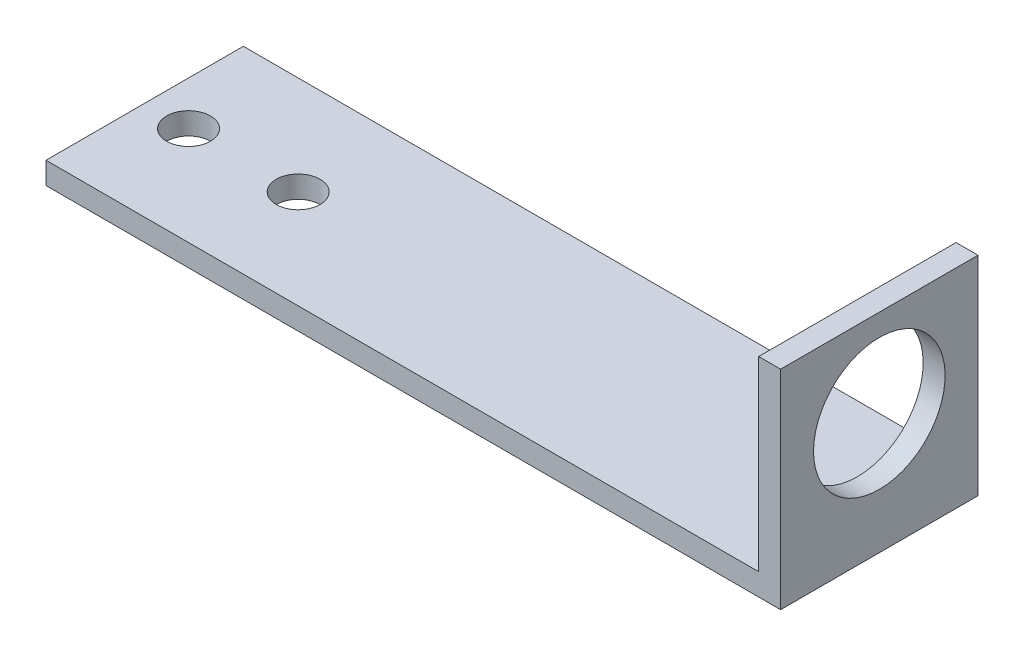
ISO-10303-21;
HEADER;
FILE_DESCRIPTION(('STEP AP214'),'2;1');
FILE_NAME('part.step','',(''),(''),'','','');
FILE_SCHEMA(('AUTOMOTIVE_DESIGN { 1 0 10303 214 1 1 1 1 }'));
ENDSEC;
DATA;
#1=APPLICATION_CONTEXT('core data for automotive mechanical design processes');
#2=APPLICATION_PROTOCOL_DEFINITION('international standard','automotive_design',2000,#1);
#3=PRODUCT_CONTEXT('',#1,'mechanical');
#4=PRODUCT('Part','Part','',(#3));
#5=PRODUCT_RELATED_PRODUCT_CATEGORY('part','',(#4));
#6=PRODUCT_DEFINITION_FORMATION('','',#4);
#7=PRODUCT_DEFINITION_CONTEXT('part definition',#1,'design');
#8=PRODUCT_DEFINITION('design','',#6,#7);
#9=PRODUCT_DEFINITION_SHAPE('','',#8);
#10=(LENGTH_UNIT() NAMED_UNIT(*) SI_UNIT(.MILLI.,.METRE.));
#11=(NAMED_UNIT(*) PLANE_ANGLE_UNIT() SI_UNIT($,.RADIAN.));
#12=(NAMED_UNIT(*) SI_UNIT($,.STERADIAN.) SOLID_ANGLE_UNIT());
#13=UNCERTAINTY_MEASURE_WITH_UNIT(LENGTH_MEASURE(1.E-05),#10,'distance_accuracy_value','');
#14=(GEOMETRIC_REPRESENTATION_CONTEXT(3) GLOBAL_UNCERTAINTY_ASSIGNED_CONTEXT((#13)) GLOBAL_UNIT_ASSIGNED_CONTEXT((#10,
#11,#12)) REPRESENTATION_CONTEXT('',''));
#15=CARTESIAN_POINT('',(0.,0.,0.));
#16=DIRECTION('',(0.,0.,1.));
#17=DIRECTION('',(1.,0.,0.));
#18=AXIS2_PLACEMENT_3D('',#15,#16,#17);
#19=CARTESIAN_POINT('',(-67.,0.,18.));
#20=DIRECTION('',(0.,1.,0.));
#21=DIRECTION('',(0.,0.,1.));
#22=AXIS2_PLACEMENT_3D('',#19,#20,#21);
#23=PLANE('',#22);
#24=CARTESIAN_POINT('',(-63.,0.,9.));
#25=DIRECTION('',(0.,1.,0.));
#26=DIRECTION('',(0.,0.,1.));
#27=AXIS2_PLACEMENT_3D('',#24,#25,#26);
#28=CIRCLE('',#27,2.);
#29=CARTESIAN_POINT('',(-63.,0.,11.));
#30=VERTEX_POINT('',#29);
#31=EDGE_CURVE('E161',#30,#30,#28,.F.);
#32=ORIENTED_EDGE('',*,*,#31,.F.);
#33=EDGE_LOOP('',(#32));
#34=FACE_BOUND('',#33,.T.);
#35=CARTESIAN_POINT('',(-53.,0.,9.));
#36=DIRECTION('',(0.,1.,0.));
#37=DIRECTION('',(0.,0.,1.));
#38=AXIS2_PLACEMENT_3D('',#35,#36,#37);
#39=CIRCLE('',#38,2.);
#40=CARTESIAN_POINT('',(-53.,0.,11.));
#41=VERTEX_POINT('',#40);
#42=EDGE_CURVE('E164',#41,#41,#39,.F.);
#43=ORIENTED_EDGE('',*,*,#42,.F.);
#44=EDGE_LOOP('',(#43));
#45=FACE_BOUND('',#44,.T.);
#46=DIRECTION('',(1.,0.,0.));
#47=VECTOR('',#46,1.);
#48=CARTESIAN_POINT('',(-67.,0.,0.));
#49=LINE('',#48,#47);
#50=CARTESIAN_POINT('',(-67.,0.,0.));
#51=VERTEX_POINT('',#50);
#52=CARTESIAN_POINT('',(0.,0.,0.));
#53=VERTEX_POINT('',#52);
#54=EDGE_CURVE('E116',#51,#53,#49,.T.);
#55=ORIENTED_EDGE('',*,*,#54,.T.);
#56=DIRECTION('',(0.,0.,-1.));
#57=VECTOR('',#56,1.);
#58=CARTESIAN_POINT('',(0.,0.,18.));
#59=LINE('',#58,#57);
#60=CARTESIAN_POINT('',(0.,0.,18.));
#61=VERTEX_POINT('',#60);
#62=EDGE_CURVE('E11',#61,#53,#59,.T.);
#63=ORIENTED_EDGE('',*,*,#62,.F.);
#64=DIRECTION('',(1.,0.,0.));
#65=VECTOR('',#64,1.);
#66=CARTESIAN_POINT('',(-67.,0.,18.));
#67=LINE('',#66,#65);
#68=CARTESIAN_POINT('',(-67.,0.,18.));
#69=VERTEX_POINT('',#68);
#70=EDGE_CURVE('E127',#69,#61,#67,.T.);
#71=ORIENTED_EDGE('',*,*,#70,.F.);
#72=DIRECTION('',(0.,0.,-1.));
#73=VECTOR('',#72,1.);
#74=CARTESIAN_POINT('',(-67.,0.,18.));
#75=LINE('',#74,#73);
#76=EDGE_CURVE('E112',#69,#51,#75,.T.);
#77=ORIENTED_EDGE('',*,*,#76,.T.);
#78=EDGE_LOOP('',(#55,#63,#71,#77));
#79=FACE_BOUND('',#78,.T.);
#80=ADVANCED_FACE('F32',(#34,#45,#79),#23,.F.);
#81=CARTESIAN_POINT('',(0.,0.,18.));
#82=DIRECTION('',(-1.,0.,0.));
#83=DIRECTION('',(0.,0.,1.));
#84=AXIS2_PLACEMENT_3D('',#81,#82,#83);
#85=PLANE('',#84);
#86=CARTESIAN_POINT('',(0.,11.,9.));
#87=DIRECTION('',(-1.,0.,0.));
#88=DIRECTION('',(0.,0.,1.));
#89=AXIS2_PLACEMENT_3D('',#86,#87,#88);
#90=CIRCLE('',#89,6.);
#91=CARTESIAN_POINT('',(0.,11.,15.));
#92=VERTEX_POINT('',#91);
#93=EDGE_CURVE('E120',#92,#92,#90,.F.);
#94=ORIENTED_EDGE('',*,*,#93,.F.);
#95=EDGE_LOOP('',(#94));
#96=FACE_BOUND('',#95,.T.);
#97=DIRECTION('',(0.,1.,0.));
#98=VECTOR('',#97,1.);
#99=CARTESIAN_POINT('',(0.,0.,0.));
#100=LINE('',#99,#98);
#101=CARTESIAN_POINT('',(0.,19.,0.));
#102=VERTEX_POINT('',#101);
#103=EDGE_CURVE('E119',#53,#102,#100,.T.);
#104=ORIENTED_EDGE('',*,*,#103,.T.);
#105=DIRECTION('',(0.,0.,-1.));
#106=VECTOR('',#105,1.);
#107=CARTESIAN_POINT('',(0.,19.,18.));
#108=LINE('',#107,#106);
#109=CARTESIAN_POINT('',(0.,19.,18.));
#110=VERTEX_POINT('',#109);
#111=EDGE_CURVE('E40',#110,#102,#108,.T.);
#112=ORIENTED_EDGE('',*,*,#111,.F.);
#113=DIRECTION('',(0.,1.,0.));
#114=VECTOR('',#113,1.);
#115=CARTESIAN_POINT('',(0.,0.,18.));
#116=LINE('',#115,#114);
#117=EDGE_CURVE('E85',#61,#110,#116,.T.);
#118=ORIENTED_EDGE('',*,*,#117,.F.);
#119=ORIENTED_EDGE('',*,*,#62,.T.);
#120=EDGE_LOOP('',(#104,#112,#118,#119));
#121=FACE_BOUND('',#120,.T.);
#122=ADVANCED_FACE('F152',(#96,#121),#85,.F.);
#123=CARTESIAN_POINT('',(0.,19.,18.));
#124=DIRECTION('',(0.,-1.,0.));
#125=DIRECTION('',(0.,0.,-1.));
#126=AXIS2_PLACEMENT_3D('',#123,#124,#125);
#127=PLANE('',#126);
#128=DIRECTION('',(-1.,0.,0.));
#129=VECTOR('',#128,1.);
#130=CARTESIAN_POINT('',(0.,19.,0.));
#131=LINE('',#130,#129);
#132=CARTESIAN_POINT('',(-2.,19.,0.));
#133=VERTEX_POINT('',#132);
#134=EDGE_CURVE('E122',#102,#133,#131,.T.);
#135=ORIENTED_EDGE('',*,*,#134,.T.);
#136=DIRECTION('',(0.,0.,-1.));
#137=VECTOR('',#136,1.);
#138=CARTESIAN_POINT('',(-2.,19.,18.));
#139=LINE('',#138,#137);
#140=CARTESIAN_POINT('',(-2.,19.,18.));
#141=VERTEX_POINT('',#140);
#142=EDGE_CURVE('E107',#141,#133,#139,.T.);
#143=ORIENTED_EDGE('',*,*,#142,.F.);
#144=DIRECTION('',(-1.,0.,0.));
#145=VECTOR('',#144,1.);
#146=CARTESIAN_POINT('',(0.,19.,18.));
#147=LINE('',#146,#145);
#148=EDGE_CURVE('E98',#110,#141,#147,.T.);
#149=ORIENTED_EDGE('',*,*,#148,.F.);
#150=ORIENTED_EDGE('',*,*,#111,.T.);
#151=EDGE_LOOP('',(#135,#143,#149,#150));
#152=FACE_BOUND('',#151,.T.);
#153=ADVANCED_FACE('F133',(#152),#127,.F.);
#154=CARTESIAN_POINT('',(-2.,19.,18.));
#155=DIRECTION('',(1.,0.,0.));
#156=DIRECTION('',(0.,1.,0.));
#157=AXIS2_PLACEMENT_3D('',#154,#155,#156);
#158=PLANE('',#157);
#159=CARTESIAN_POINT('',(-2.,11.,9.));
#160=DIRECTION('',(-1.,0.,0.));
#161=DIRECTION('',(0.,-1.,0.));
#162=AXIS2_PLACEMENT_3D('',#159,#160,#161);
#163=CIRCLE('',#162,6.);
#164=CARTESIAN_POINT('',(-2.,5.,9.));
#165=VERTEX_POINT('',#164);
#166=EDGE_CURVE('E175',#165,#165,#163,.T.);
#167=ORIENTED_EDGE('',*,*,#166,.F.);
#168=EDGE_LOOP('',(#167));
#169=FACE_BOUND('',#168,.T.);
#170=DIRECTION('',(0.,-1.,0.));
#171=VECTOR('',#170,1.);
#172=CARTESIAN_POINT('',(-2.,19.,0.));
#173=LINE('',#172,#171);
#174=CARTESIAN_POINT('',(-2.,2.00000000000001,0.));
#175=VERTEX_POINT('',#174);
#176=EDGE_CURVE('E106',#133,#175,#173,.T.);
#177=ORIENTED_EDGE('',*,*,#176,.T.);
#178=DIRECTION('',(0.,0.,-1.));
#179=VECTOR('',#178,1.);
#180=CARTESIAN_POINT('',(-2.,2.00000000000001,18.));
#181=LINE('',#180,#179);
#182=CARTESIAN_POINT('',(-2.,2.00000000000001,18.));
#183=VERTEX_POINT('',#182);
#184=EDGE_CURVE('E103',#183,#175,#181,.T.);
#185=ORIENTED_EDGE('',*,*,#184,.F.);
#186=DIRECTION('',(0.,-1.,0.));
#187=VECTOR('',#186,1.);
#188=CARTESIAN_POINT('',(-2.,19.,18.));
#189=LINE('',#188,#187);
#190=EDGE_CURVE('E92',#141,#183,#189,.T.);
#191=ORIENTED_EDGE('',*,*,#190,.F.);
#192=ORIENTED_EDGE('',*,*,#142,.T.);
#193=EDGE_LOOP('',(#177,#185,#191,#192));
#194=FACE_BOUND('',#193,.T.);
#195=ADVANCED_FACE('F104',(#169,#194),#158,.F.);
#196=CARTESIAN_POINT('',(-2.,2.00000000000001,18.));
#197=DIRECTION('',(0.,-1.,0.));
#198=DIRECTION('',(1.,0.,0.));
#199=AXIS2_PLACEMENT_3D('',#196,#197,#198);
#200=PLANE('',#199);
#201=CARTESIAN_POINT('',(-63.,2.,9.));
#202=DIRECTION('',(0.,1.,0.));
#203=DIRECTION('',(-1.,0.,0.));
#204=AXIS2_PLACEMENT_3D('',#201,#202,#203);
#205=CIRCLE('',#204,2.);
#206=CARTESIAN_POINT('',(-65.,2.,9.));
#207=VERTEX_POINT('',#206);
#208=EDGE_CURVE('E166',#207,#207,#205,.T.);
#209=ORIENTED_EDGE('',*,*,#208,.F.);
#210=EDGE_LOOP('',(#209));
#211=FACE_BOUND('',#210,.T.);
#212=CARTESIAN_POINT('',(-53.,2.,9.));
#213=DIRECTION('',(0.,1.,0.));
#214=DIRECTION('',(-1.,0.,0.));
#215=AXIS2_PLACEMENT_3D('',#212,#213,#214);
#216=CIRCLE('',#215,2.);
#217=CARTESIAN_POINT('',(-55.,2.,9.));
#218=VERTEX_POINT('',#217);
#219=EDGE_CURVE('E167',#218,#218,#216,.T.);
#220=ORIENTED_EDGE('',*,*,#219,.F.);
#221=EDGE_LOOP('',(#220));
#222=FACE_BOUND('',#221,.T.);
#223=DIRECTION('',(-1.,0.,0.));
#224=VECTOR('',#223,1.);
#225=CARTESIAN_POINT('',(-2.,2.00000000000001,0.));
#226=LINE('',#225,#224);
#227=CARTESIAN_POINT('',(-67.,2.,0.));
#228=VERTEX_POINT('',#227);
#229=EDGE_CURVE('E71',#175,#228,#226,.T.);
#230=ORIENTED_EDGE('',*,*,#229,.T.);
#231=DIRECTION('',(0.,0.,-1.));
#232=VECTOR('',#231,1.);
#233=CARTESIAN_POINT('',(-67.,2.,18.));
#234=LINE('',#233,#232);
#235=CARTESIAN_POINT('',(-67.,2.,18.));
#236=VERTEX_POINT('',#235);
#237=EDGE_CURVE('E108',#236,#228,#234,.T.);
#238=ORIENTED_EDGE('',*,*,#237,.F.);
#239=DIRECTION('',(-1.,0.,0.));
#240=VECTOR('',#239,1.);
#241=CARTESIAN_POINT('',(-2.,2.00000000000001,18.));
#242=LINE('',#241,#240);
#243=EDGE_CURVE('E96',#183,#236,#242,.T.);
#244=ORIENTED_EDGE('',*,*,#243,.F.);
#245=ORIENTED_EDGE('',*,*,#184,.T.);
#246=EDGE_LOOP('',(#230,#238,#244,#245));
#247=FACE_BOUND('',#246,.T.);
#248=ADVANCED_FACE('F110',(#211,#222,#247),#200,.F.);
#249=CARTESIAN_POINT('',(-67.,2.,18.));
#250=DIRECTION('',(1.,0.,0.));
#251=DIRECTION('',(0.,0.,-1.));
#252=AXIS2_PLACEMENT_3D('',#249,#250,#251);
#253=PLANE('',#252);
#254=DIRECTION('',(0.,-1.,0.));
#255=VECTOR('',#254,1.);
#256=CARTESIAN_POINT('',(-67.,2.,0.));
#257=LINE('',#256,#255);
#258=EDGE_CURVE('E77',#228,#51,#257,.T.);
#259=ORIENTED_EDGE('',*,*,#258,.T.);
#260=ORIENTED_EDGE('',*,*,#76,.F.);
#261=DIRECTION('',(0.,-1.,0.));
#262=VECTOR('',#261,1.);
#263=CARTESIAN_POINT('',(-67.,2.,18.));
#264=LINE('',#263,#262);
#265=EDGE_CURVE('E48',#236,#69,#264,.T.);
#266=ORIENTED_EDGE('',*,*,#265,.F.);
#267=ORIENTED_EDGE('',*,*,#237,.T.);
#268=EDGE_LOOP('',(#259,#260,#266,#267));
#269=FACE_BOUND('',#268,.T.);
#270=ADVANCED_FACE('F140',(#269),#253,.F.);
#271=CARTESIAN_POINT('',(0.,0.,18.));
#272=DIRECTION('',(0.,0.,1.));
#273=DIRECTION('',(1.,0.,0.));
#274=AXIS2_PLACEMENT_3D('',#271,#272,#273);
#275=PLANE('',#274);
#276=ORIENTED_EDGE('',*,*,#70,.T.);
#277=ORIENTED_EDGE('',*,*,#117,.T.);
#278=ORIENTED_EDGE('',*,*,#148,.T.);
#279=ORIENTED_EDGE('',*,*,#190,.T.);
#280=ORIENTED_EDGE('',*,*,#243,.T.);
#281=ORIENTED_EDGE('',*,*,#265,.T.);
#282=EDGE_LOOP('',(#276,#277,#278,#279,#280,#281));
#283=FACE_BOUND('',#282,.T.);
#284=ADVANCED_FACE('F94',(#283),#275,.T.);
#285=CARTESIAN_POINT('',(0.,0.,0.));
#286=DIRECTION('',(0.,0.,1.));
#287=DIRECTION('',(1.,0.,0.));
#288=AXIS2_PLACEMENT_3D('',#285,#286,#287);
#289=PLANE('',#288);
#290=ORIENTED_EDGE('',*,*,#54,.F.);
#291=ORIENTED_EDGE('',*,*,#258,.F.);
#292=ORIENTED_EDGE('',*,*,#229,.F.);
#293=ORIENTED_EDGE('',*,*,#176,.F.);
#294=ORIENTED_EDGE('',*,*,#134,.F.);
#295=ORIENTED_EDGE('',*,*,#103,.F.);
#296=EDGE_LOOP('',(#290,#291,#292,#293,#294,#295));
#297=FACE_BOUND('',#296,.T.);
#298=ADVANCED_FACE('F136',(#297),#289,.F.);
#299=CARTESIAN_POINT('',(0.001000000000001,11.,9.));
#300=DIRECTION('',(-1.,0.,0.));
#301=DIRECTION('',(0.,-1.,0.));
#302=AXIS2_PLACEMENT_3D('',#299,#300,#301);
#303=CYLINDRICAL_SURFACE('',#302,6.);
#304=ORIENTED_EDGE('',*,*,#166,.T.);
#305=EDGE_LOOP('',(#304));
#306=FACE_BOUND('',#305,.T.);
#307=ORIENTED_EDGE('',*,*,#93,.T.);
#308=EDGE_LOOP('',(#307));
#309=FACE_BOUND('',#308,.T.);
#310=ADVANCED_FACE('F183',(#306,#309),#303,.F.);
#311=CARTESIAN_POINT('',(-53.,-0.00100000000000664,9.));
#312=DIRECTION('',(0.,1.,0.));
#313=DIRECTION('',(-1.,0.,0.));
#314=AXIS2_PLACEMENT_3D('',#311,#312,#313);
#315=CYLINDRICAL_SURFACE('',#314,2.);
#316=ORIENTED_EDGE('',*,*,#219,.T.);
#317=EDGE_LOOP('',(#316));
#318=FACE_BOUND('',#317,.T.);
#319=ORIENTED_EDGE('',*,*,#42,.T.);
#320=EDGE_LOOP('',(#319));
#321=FACE_BOUND('',#320,.T.);
#322=ADVANCED_FACE('F185',(#318,#321),#315,.F.);
#323=CARTESIAN_POINT('',(-63.,-0.00100000000000751,9.));
#324=DIRECTION('',(0.,1.,0.));
#325=DIRECTION('',(-1.,0.,0.));
#326=AXIS2_PLACEMENT_3D('',#323,#324,#325);
#327=CYLINDRICAL_SURFACE('',#326,2.);
#328=ORIENTED_EDGE('',*,*,#208,.T.);
#329=EDGE_LOOP('',(#328));
#330=FACE_BOUND('',#329,.T.);
#331=ORIENTED_EDGE('',*,*,#31,.T.);
#332=EDGE_LOOP('',(#331));
#333=FACE_BOUND('',#332,.T.);
#334=ADVANCED_FACE('F192',(#330,#333),#327,.F.);
#335=CLOSED_SHELL('',(#80,#122,#153,#195,#248,#270,#284,#298,#310,#322,#334));
#336=MANIFOLD_SOLID_BREP('B2',#335);
#337=ADVANCED_BREP_SHAPE_REPRESENTATION('',(#18,#336),#14);
#338=SHAPE_DEFINITION_REPRESENTATION(#9,#337);
ENDSEC;
END-ISO-10303-21;
